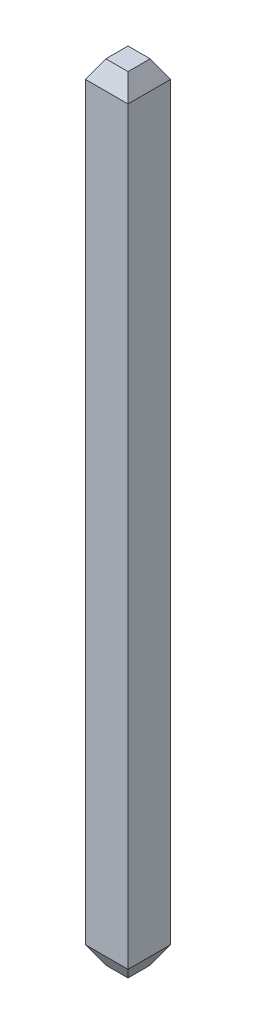
ISO-10303-21;
HEADER;
FILE_DESCRIPTION(('STEP AP214'),'2;1');
FILE_NAME('part.step','',(''),(''),'','','');
FILE_SCHEMA(('AUTOMOTIVE_DESIGN { 1 0 10303 214 1 1 1 1 }'));
ENDSEC;
DATA;
#1=APPLICATION_CONTEXT('core data for automotive mechanical design processes');
#2=APPLICATION_PROTOCOL_DEFINITION('international standard','automotive_design',2000,#1);
#3=PRODUCT_CONTEXT('',#1,'mechanical');
#4=PRODUCT('Part','Part','',(#3));
#5=PRODUCT_RELATED_PRODUCT_CATEGORY('part','',(#4));
#6=PRODUCT_DEFINITION_FORMATION('','',#4);
#7=PRODUCT_DEFINITION_CONTEXT('part definition',#1,'design');
#8=PRODUCT_DEFINITION('design','',#6,#7);
#9=PRODUCT_DEFINITION_SHAPE('','',#8);
#10=(LENGTH_UNIT() NAMED_UNIT(*) SI_UNIT(.MILLI.,.METRE.));
#11=(NAMED_UNIT(*) PLANE_ANGLE_UNIT() SI_UNIT($,.RADIAN.));
#12=(NAMED_UNIT(*) SI_UNIT($,.STERADIAN.) SOLID_ANGLE_UNIT());
#13=UNCERTAINTY_MEASURE_WITH_UNIT(LENGTH_MEASURE(1.E-05),#10,'distance_accuracy_value','');
#14=(GEOMETRIC_REPRESENTATION_CONTEXT(3) GLOBAL_UNCERTAINTY_ASSIGNED_CONTEXT((#13)) GLOBAL_UNIT_ASSIGNED_CONTEXT((#10,
#11,#12)) REPRESENTATION_CONTEXT('',''));
#15=CARTESIAN_POINT('',(0.,0.,0.));
#16=DIRECTION('',(0.,0.,1.));
#17=DIRECTION('',(1.,0.,0.));
#18=AXIS2_PLACEMENT_3D('',#15,#16,#17);
#19=CARTESIAN_POINT('',(2.2225,-5.58,1.105));
#20=DIRECTION('',(0.,0.50000000000019,0.866025403784329));
#21=DIRECTION('',(1.,0.,0.));
#22=AXIS2_PLACEMENT_3D('',#19,#20,#21);
#23=PLANE('',#22);
#24=DIRECTION('',(-0.44721359550015,0.774596669241261,-0.44721359550015));
#25=VECTOR('',#24,1.);
#26=CARTESIAN_POINT('',(2.375,-5.58,1.105));
#27=LINE('',#26,#25);
#28=CARTESIAN_POINT('',(2.375,-5.58,1.105));
#29=VERTEX_POINT('',#28);
#30=CARTESIAN_POINT('',(2.2225,-5.31586225185,0.9525));
#31=VERTEX_POINT('',#30);
#32=EDGE_CURVE('E193',#29,#31,#27,.T.);
#33=ORIENTED_EDGE('',*,*,#32,.T.);
#34=DIRECTION('',(1.,0.,0.));
#35=VECTOR('',#34,1.);
#36=CARTESIAN_POINT('',(2.2225,-5.31586225185,0.9525));
#37=LINE('',#36,#35);
#38=CARTESIAN_POINT('',(2.8575,-5.31586225185,0.9525));
#39=VERTEX_POINT('',#38);
#40=EDGE_CURVE('E213',#31,#39,#37,.T.);
#41=ORIENTED_EDGE('',*,*,#40,.T.);
#42=DIRECTION('',(0.44721359550015,0.774596669241261,-0.44721359550015));
#43=VECTOR('',#42,1.);
#44=CARTESIAN_POINT('',(2.705,-5.58,1.105));
#45=LINE('',#44,#43);
#46=CARTESIAN_POINT('',(2.705,-5.58,1.105));
#47=VERTEX_POINT('',#46);
#48=EDGE_CURVE('E27',#47,#39,#45,.T.);
#49=ORIENTED_EDGE('',*,*,#48,.F.);
#50=DIRECTION('',(1.,0.,0.));
#51=VECTOR('',#50,1.);
#52=CARTESIAN_POINT('',(2.375,-5.58,1.105));
#53=LINE('',#52,#51);
#54=EDGE_CURVE('E183',#29,#47,#53,.T.);
#55=ORIENTED_EDGE('',*,*,#54,.F.);
#56=EDGE_LOOP('',(#33,#41,#49,#55));
#57=FACE_BOUND('',#56,.T.);
#58=ADVANCED_FACE('F16',(#57),#23,.F.);
#59=CARTESIAN_POINT('',(2.8575,-5.58,1.435));
#60=DIRECTION('',(0.,0.50000000000019,-0.866025403784329));
#61=DIRECTION('',(-1.,0.,0.));
#62=AXIS2_PLACEMENT_3D('',#59,#60,#61);
#63=PLANE('',#62);
#64=DIRECTION('',(0.44721359550015,0.774596669241261,0.44721359550015));
#65=VECTOR('',#64,1.);
#66=CARTESIAN_POINT('',(2.705,-5.58,1.435));
#67=LINE('',#66,#65);
#68=CARTESIAN_POINT('',(2.705,-5.58,1.435));
#69=VERTEX_POINT('',#68);
#70=CARTESIAN_POINT('',(2.8575,-5.31586225185,1.5875));
#71=VERTEX_POINT('',#70);
#72=EDGE_CURVE('E11',#69,#71,#67,.T.);
#73=ORIENTED_EDGE('',*,*,#72,.T.);
#74=DIRECTION('',(-1.,0.,0.));
#75=VECTOR('',#74,1.);
#76=CARTESIAN_POINT('',(2.8575,-5.31586225185,1.5875));
#77=LINE('',#76,#75);
#78=CARTESIAN_POINT('',(2.2225,-5.31586225185,1.5875));
#79=VERTEX_POINT('',#78);
#80=EDGE_CURVE('E178',#71,#79,#77,.T.);
#81=ORIENTED_EDGE('',*,*,#80,.T.);
#82=DIRECTION('',(-0.44721359550015,0.774596669241261,0.44721359550015));
#83=VECTOR('',#82,1.);
#84=CARTESIAN_POINT('',(2.375,-5.58,1.435));
#85=LINE('',#84,#83);
#86=CARTESIAN_POINT('',(2.375,-5.58,1.435));
#87=VERTEX_POINT('',#86);
#88=EDGE_CURVE('E130',#87,#79,#85,.T.);
#89=ORIENTED_EDGE('',*,*,#88,.F.);
#90=DIRECTION('',(-1.,0.,0.));
#91=VECTOR('',#90,1.);
#92=CARTESIAN_POINT('',(2.705,-5.58,1.435));
#93=LINE('',#92,#91);
#94=EDGE_CURVE('E179',#69,#87,#93,.T.);
#95=ORIENTED_EDGE('',*,*,#94,.F.);
#96=EDGE_LOOP('',(#73,#81,#89,#95));
#97=FACE_BOUND('',#96,.T.);
#98=ADVANCED_FACE('F248',(#97),#63,.F.);
#99=CARTESIAN_POINT('',(2.705,-5.58,0.9525));
#100=DIRECTION('',(-0.866025403784329,0.50000000000019,0.));
#101=DIRECTION('',(0.,0.,1.));
#102=AXIS2_PLACEMENT_3D('',#99,#100,#101);
#103=PLANE('',#102);
#104=ORIENTED_EDGE('',*,*,#48,.T.);
#105=DIRECTION('',(0.,0.,1.));
#106=VECTOR('',#105,1.);
#107=CARTESIAN_POINT('',(2.8575,-5.31586225185,0.9525));
#108=LINE('',#107,#106);
#109=EDGE_CURVE('E177',#39,#71,#108,.T.);
#110=ORIENTED_EDGE('',*,*,#109,.T.);
#111=ORIENTED_EDGE('',*,*,#72,.F.);
#112=DIRECTION('',(0.,0.,1.));
#113=VECTOR('',#112,1.);
#114=CARTESIAN_POINT('',(2.705,-5.58,1.105));
#115=LINE('',#114,#113);
#116=EDGE_CURVE('E200',#47,#69,#115,.T.);
#117=ORIENTED_EDGE('',*,*,#116,.F.);
#118=EDGE_LOOP('',(#104,#110,#111,#117));
#119=FACE_BOUND('',#118,.T.);
#120=ADVANCED_FACE('F262',(#119),#103,.F.);
#121=CARTESIAN_POINT('',(2.54,-5.58,1.27));
#122=DIRECTION('',(0.,-1.,0.));
#123=DIRECTION('',(0.,0.,-1.));
#124=AXIS2_PLACEMENT_3D('',#121,#122,#123);
#125=PLANE('',#124);
#126=ORIENTED_EDGE('',*,*,#94,.T.);
#127=DIRECTION('',(0.,0.,-1.));
#128=VECTOR('',#127,1.);
#129=CARTESIAN_POINT('',(2.375,-5.58,1.435));
#130=LINE('',#129,#128);
#131=EDGE_CURVE('E184',#87,#29,#130,.T.);
#132=ORIENTED_EDGE('',*,*,#131,.T.);
#133=ORIENTED_EDGE('',*,*,#54,.T.);
#134=ORIENTED_EDGE('',*,*,#116,.T.);
#135=EDGE_LOOP('',(#126,#132,#133,#134));
#136=FACE_BOUND('',#135,.T.);
#137=ADVANCED_FACE('F251',(#136),#125,.T.);
#138=CARTESIAN_POINT('',(2.375,-5.58,1.5875));
#139=DIRECTION('',(0.866025403784329,0.50000000000019,0.));
#140=DIRECTION('',(0.,0.,-1.));
#141=AXIS2_PLACEMENT_3D('',#138,#139,#140);
#142=PLANE('',#141);
#143=ORIENTED_EDGE('',*,*,#88,.T.);
#144=DIRECTION('',(0.,0.,-1.));
#145=VECTOR('',#144,1.);
#146=CARTESIAN_POINT('',(2.2225,-5.31586225185,1.5875));
#147=LINE('',#146,#145);
#148=EDGE_CURVE('E20',#79,#31,#147,.T.);
#149=ORIENTED_EDGE('',*,*,#148,.T.);
#150=ORIENTED_EDGE('',*,*,#32,.F.);
#151=ORIENTED_EDGE('',*,*,#131,.F.);
#152=EDGE_LOOP('',(#143,#149,#150,#151));
#153=FACE_BOUND('',#152,.T.);
#154=ADVANCED_FACE('F252',(#153),#142,.F.);
#155=CARTESIAN_POINT('',(2.2225,6.1,1.5875));
#156=DIRECTION('',(-1.,0.,0.));
#157=DIRECTION('',(0.,0.,1.));
#158=AXIS2_PLACEMENT_3D('',#155,#156,#157);
#159=PLANE('',#158);
#160=DIRECTION('',(0.,-1.,0.));
#161=VECTOR('',#160,1.);
#162=CARTESIAN_POINT('',(2.2225,5.835862251846,0.9525));
#163=LINE('',#162,#161);
#164=CARTESIAN_POINT('',(2.2225,5.835862251846,0.9525));
#165=VERTEX_POINT('',#164);
#166=EDGE_CURVE('E58',#165,#31,#163,.T.);
#167=ORIENTED_EDGE('',*,*,#166,.T.);
#168=ORIENTED_EDGE('',*,*,#148,.F.);
#169=DIRECTION('',(0.,-1.,0.));
#170=VECTOR('',#169,1.);
#171=CARTESIAN_POINT('',(2.2225,5.835862251846,1.5875));
#172=LINE('',#171,#170);
#173=CARTESIAN_POINT('',(2.2225,5.835862251846,1.5875));
#174=VERTEX_POINT('',#173);
#175=EDGE_CURVE('E186',#174,#79,#172,.T.);
#176=ORIENTED_EDGE('',*,*,#175,.F.);
#177=DIRECTION('',(0.,0.,-1.));
#178=VECTOR('',#177,1.);
#179=CARTESIAN_POINT('',(2.2225,5.835862251846,1.5875));
#180=LINE('',#179,#178);
#181=EDGE_CURVE('E171',#174,#165,#180,.T.);
#182=ORIENTED_EDGE('',*,*,#181,.T.);
#183=EDGE_LOOP('',(#167,#168,#176,#182));
#184=FACE_BOUND('',#183,.T.);
#185=ADVANCED_FACE('F254',(#184),#159,.T.);
#186=CARTESIAN_POINT('',(2.2225,6.1,0.9525));
#187=DIRECTION('',(0.,0.,-1.));
#188=DIRECTION('',(0.,-1.,0.));
#189=AXIS2_PLACEMENT_3D('',#186,#187,#188);
#190=PLANE('',#189);
#191=DIRECTION('',(0.,-1.,0.));
#192=VECTOR('',#191,1.);
#193=CARTESIAN_POINT('',(2.8575,5.835862251846,0.9525));
#194=LINE('',#193,#192);
#195=CARTESIAN_POINT('',(2.8575,5.835862251846,0.9525));
#196=VERTEX_POINT('',#195);
#197=EDGE_CURVE('E73',#196,#39,#194,.T.);
#198=ORIENTED_EDGE('',*,*,#197,.T.);
#199=ORIENTED_EDGE('',*,*,#40,.F.);
#200=ORIENTED_EDGE('',*,*,#166,.F.);
#201=DIRECTION('',(1.,0.,0.));
#202=VECTOR('',#201,1.);
#203=CARTESIAN_POINT('',(2.2225,5.835862251846,0.9525));
#204=LINE('',#203,#202);
#205=EDGE_CURVE('E172',#165,#196,#204,.T.);
#206=ORIENTED_EDGE('',*,*,#205,.T.);
#207=EDGE_LOOP('',(#198,#199,#200,#206));
#208=FACE_BOUND('',#207,.T.);
#209=ADVANCED_FACE('F243',(#208),#190,.T.);
#210=CARTESIAN_POINT('',(2.8575,6.1,0.9525));
#211=DIRECTION('',(1.,0.,0.));
#212=DIRECTION('',(0.,1.,0.));
#213=AXIS2_PLACEMENT_3D('',#210,#211,#212);
#214=PLANE('',#213);
#215=DIRECTION('',(0.,-1.,0.));
#216=VECTOR('',#215,1.);
#217=CARTESIAN_POINT('',(2.8575,5.835862251846,1.5875));
#218=LINE('',#217,#216);
#219=CARTESIAN_POINT('',(2.8575,5.835862251846,1.5875));
#220=VERTEX_POINT('',#219);
#221=EDGE_CURVE('E173',#220,#71,#218,.T.);
#222=ORIENTED_EDGE('',*,*,#221,.T.);
#223=ORIENTED_EDGE('',*,*,#109,.F.);
#224=ORIENTED_EDGE('',*,*,#197,.F.);
#225=DIRECTION('',(0.,0.,1.));
#226=VECTOR('',#225,1.);
#227=CARTESIAN_POINT('',(2.8575,5.835862251846,0.9525));
#228=LINE('',#227,#226);
#229=EDGE_CURVE('E148',#196,#220,#228,.T.);
#230=ORIENTED_EDGE('',*,*,#229,.T.);
#231=EDGE_LOOP('',(#222,#223,#224,#230));
#232=FACE_BOUND('',#231,.T.);
#233=ADVANCED_FACE('F245',(#232),#214,.T.);
#234=CARTESIAN_POINT('',(2.8575,6.1,1.5875));
#235=DIRECTION('',(0.,0.,1.));
#236=DIRECTION('',(1.,0.,0.));
#237=AXIS2_PLACEMENT_3D('',#234,#235,#236);
#238=PLANE('',#237);
#239=ORIENTED_EDGE('',*,*,#175,.T.);
#240=ORIENTED_EDGE('',*,*,#80,.F.);
#241=ORIENTED_EDGE('',*,*,#221,.F.);
#242=DIRECTION('',(-1.,0.,0.));
#243=VECTOR('',#242,1.);
#244=CARTESIAN_POINT('',(2.8575,5.835862251846,1.5875));
#245=LINE('',#244,#243);
#246=EDGE_CURVE('E146',#220,#174,#245,.T.);
#247=ORIENTED_EDGE('',*,*,#246,.T.);
#248=EDGE_LOOP('',(#239,#240,#241,#247));
#249=FACE_BOUND('',#248,.T.);
#250=ADVANCED_FACE('F18',(#249),#238,.T.);
#251=CARTESIAN_POINT('',(2.8575,6.1,1.435));
#252=DIRECTION('',(0.,0.50000000000019,0.866025403784329));
#253=DIRECTION('',(1.,0.,0.));
#254=AXIS2_PLACEMENT_3D('',#251,#252,#253);
#255=PLANE('',#254);
#256=DIRECTION('',(-0.44721359550015,-0.774596669241261,0.44721359550015));
#257=VECTOR('',#256,1.);
#258=CARTESIAN_POINT('',(2.375,6.1,1.435));
#259=LINE('',#258,#257);
#260=CARTESIAN_POINT('',(2.375,6.1,1.435));
#261=VERTEX_POINT('',#260);
#262=EDGE_CURVE('E190',#261,#174,#259,.T.);
#263=ORIENTED_EDGE('',*,*,#262,.T.);
#264=ORIENTED_EDGE('',*,*,#246,.F.);
#265=DIRECTION('',(0.44721359550015,-0.774596669241261,0.44721359550015));
#266=VECTOR('',#265,1.);
#267=CARTESIAN_POINT('',(2.705,6.1,1.435));
#268=LINE('',#267,#266);
#269=CARTESIAN_POINT('',(2.705,6.1,1.435));
#270=VERTEX_POINT('',#269);
#271=EDGE_CURVE('E139',#270,#220,#268,.T.);
#272=ORIENTED_EDGE('',*,*,#271,.F.);
#273=DIRECTION('',(-1.,0.,0.));
#274=VECTOR('',#273,1.);
#275=CARTESIAN_POINT('',(2.705,6.1,1.435));
#276=LINE('',#275,#274);
#277=EDGE_CURVE('E143',#270,#261,#276,.T.);
#278=ORIENTED_EDGE('',*,*,#277,.T.);
#279=EDGE_LOOP('',(#263,#264,#272,#278));
#280=FACE_BOUND('',#279,.T.);
#281=ADVANCED_FACE('F141',(#280),#255,.T.);
#282=CARTESIAN_POINT('',(2.375,6.1,1.5875));
#283=DIRECTION('',(-0.866025403784329,0.50000000000019,0.));
#284=DIRECTION('',(0.,0.,1.));
#285=AXIS2_PLACEMENT_3D('',#282,#283,#284);
#286=PLANE('',#285);
#287=DIRECTION('',(-0.44721359550015,-0.774596669241261,-0.44721359550015));
#288=VECTOR('',#287,1.);
#289=CARTESIAN_POINT('',(2.375,6.1,1.105));
#290=LINE('',#289,#288);
#291=CARTESIAN_POINT('',(2.375,6.1,1.105));
#292=VERTEX_POINT('',#291);
#293=EDGE_CURVE('E104',#292,#165,#290,.T.);
#294=ORIENTED_EDGE('',*,*,#293,.T.);
#295=ORIENTED_EDGE('',*,*,#181,.F.);
#296=ORIENTED_EDGE('',*,*,#262,.F.);
#297=DIRECTION('',(0.,0.,-1.));
#298=VECTOR('',#297,1.);
#299=CARTESIAN_POINT('',(2.375,6.1,1.435));
#300=LINE('',#299,#298);
#301=EDGE_CURVE('E157',#261,#292,#300,.T.);
#302=ORIENTED_EDGE('',*,*,#301,.T.);
#303=EDGE_LOOP('',(#294,#295,#296,#302));
#304=FACE_BOUND('',#303,.T.);
#305=ADVANCED_FACE('F282',(#304),#286,.T.);
#306=CARTESIAN_POINT('',(2.2225,6.1,1.105));
#307=DIRECTION('',(0.,0.50000000000019,-0.866025403784329));
#308=DIRECTION('',(-1.,0.,0.));
#309=AXIS2_PLACEMENT_3D('',#306,#307,#308);
#310=PLANE('',#309);
#311=DIRECTION('',(0.44721359550015,-0.774596669241261,-0.44721359550015));
#312=VECTOR('',#311,1.);
#313=CARTESIAN_POINT('',(2.705,6.1,1.105));
#314=LINE('',#313,#312);
#315=CARTESIAN_POINT('',(2.705,6.1,1.105));
#316=VERTEX_POINT('',#315);
#317=EDGE_CURVE('E89',#316,#196,#314,.T.);
#318=ORIENTED_EDGE('',*,*,#317,.T.);
#319=ORIENTED_EDGE('',*,*,#205,.F.);
#320=ORIENTED_EDGE('',*,*,#293,.F.);
#321=DIRECTION('',(1.,0.,0.));
#322=VECTOR('',#321,1.);
#323=CARTESIAN_POINT('',(2.375,6.1,1.105));
#324=LINE('',#323,#322);
#325=EDGE_CURVE('E164',#292,#316,#324,.T.);
#326=ORIENTED_EDGE('',*,*,#325,.T.);
#327=EDGE_LOOP('',(#318,#319,#320,#326));
#328=FACE_BOUND('',#327,.T.);
#329=ADVANCED_FACE('F244',(#328),#310,.T.);
#330=CARTESIAN_POINT('',(2.705,6.1,0.9525));
#331=DIRECTION('',(0.866025403784329,0.50000000000019,0.));
#332=DIRECTION('',(0.,0.,-1.));
#333=AXIS2_PLACEMENT_3D('',#330,#331,#332);
#334=PLANE('',#333);
#335=ORIENTED_EDGE('',*,*,#271,.T.);
#336=ORIENTED_EDGE('',*,*,#229,.F.);
#337=ORIENTED_EDGE('',*,*,#317,.F.);
#338=DIRECTION('',(0.,0.,1.));
#339=VECTOR('',#338,1.);
#340=CARTESIAN_POINT('',(2.705,6.1,1.105));
#341=LINE('',#340,#339);
#342=EDGE_CURVE('E149',#316,#270,#341,.T.);
#343=ORIENTED_EDGE('',*,*,#342,.T.);
#344=EDGE_LOOP('',(#335,#336,#337,#343));
#345=FACE_BOUND('',#344,.T.);
#346=ADVANCED_FACE('F151',(#345),#334,.T.);
#347=CARTESIAN_POINT('',(2.54,6.1,1.27));
#348=DIRECTION('',(0.,-1.,0.));
#349=DIRECTION('',(0.,0.,-1.));
#350=AXIS2_PLACEMENT_3D('',#347,#348,#349);
#351=PLANE('',#350);
#352=ORIENTED_EDGE('',*,*,#325,.F.);
#353=ORIENTED_EDGE('',*,*,#301,.F.);
#354=ORIENTED_EDGE('',*,*,#277,.F.);
#355=ORIENTED_EDGE('',*,*,#342,.F.);
#356=EDGE_LOOP('',(#352,#353,#354,#355));
#357=FACE_BOUND('',#356,.T.);
#358=ADVANCED_FACE('F156',(#357),#351,.F.);
#359=CLOSED_SHELL('',(#58,#98,#120,#137,#154,#185,#209,#233,#250,#281,#305,#329,#346,#358));
#360=MANIFOLD_SOLID_BREP('B1',#359);
#361=ADVANCED_BREP_SHAPE_REPRESENTATION('',(#18,#360),#14);
#362=SHAPE_DEFINITION_REPRESENTATION(#9,#361);
ENDSEC;
END-ISO-10303-21;
